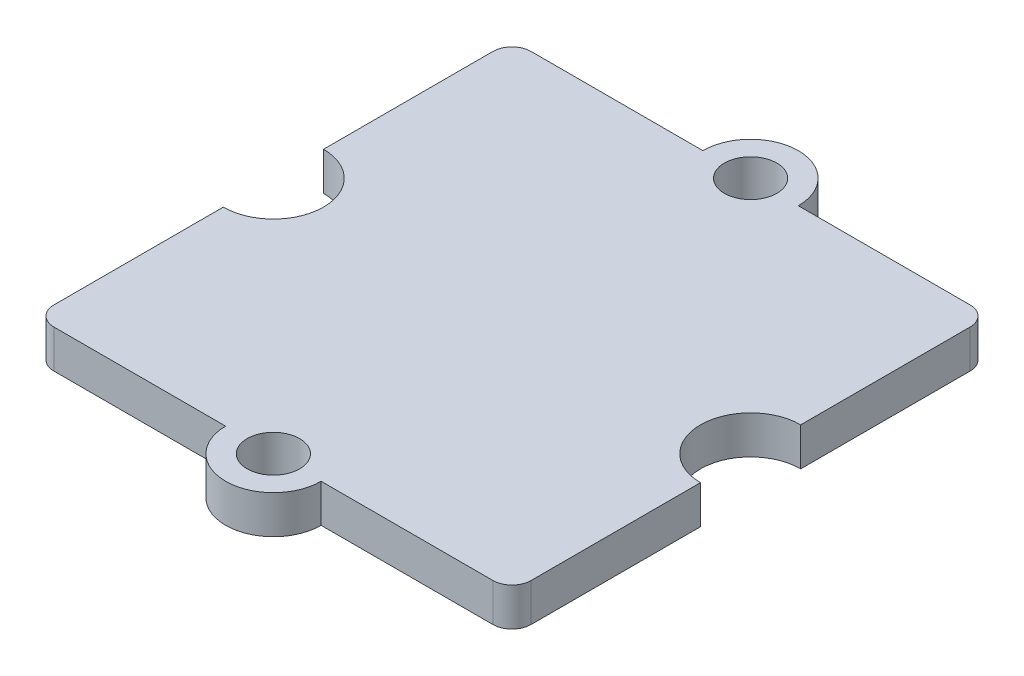
ISO-10303-21;
HEADER;
FILE_DESCRIPTION(('STEP AP214'),'2;1');
FILE_NAME('part.step','',(''),(''),'','','');
FILE_SCHEMA(('AUTOMOTIVE_DESIGN { 1 0 10303 214 1 1 1 1 }'));
ENDSEC;
DATA;
#1=APPLICATION_CONTEXT('core data for automotive mechanical design processes');
#2=APPLICATION_PROTOCOL_DEFINITION('international standard','automotive_design',2000,#1);
#3=PRODUCT_CONTEXT('',#1,'mechanical');
#4=PRODUCT('Part','Part','',(#3));
#5=PRODUCT_RELATED_PRODUCT_CATEGORY('part','',(#4));
#6=PRODUCT_DEFINITION_FORMATION('','',#4);
#7=PRODUCT_DEFINITION_CONTEXT('part definition',#1,'design');
#8=PRODUCT_DEFINITION('design','',#6,#7);
#9=PRODUCT_DEFINITION_SHAPE('','',#8);
#10=(LENGTH_UNIT() NAMED_UNIT(*) SI_UNIT(.MILLI.,.METRE.));
#11=(NAMED_UNIT(*) PLANE_ANGLE_UNIT() SI_UNIT($,.RADIAN.));
#12=(NAMED_UNIT(*) SI_UNIT($,.STERADIAN.) SOLID_ANGLE_UNIT());
#13=UNCERTAINTY_MEASURE_WITH_UNIT(LENGTH_MEASURE(1.E-05),#10,'distance_accuracy_value','');
#14=(GEOMETRIC_REPRESENTATION_CONTEXT(3) GLOBAL_UNCERTAINTY_ASSIGNED_CONTEXT((#13)) GLOBAL_UNIT_ASSIGNED_CONTEXT((#10,
#11,#12)) REPRESENTATION_CONTEXT('',''));
#15=CARTESIAN_POINT('',(0.,0.,0.));
#16=DIRECTION('',(0.,0.,1.));
#17=DIRECTION('',(1.,0.,0.));
#18=AXIS2_PLACEMENT_3D('',#15,#16,#17);
#19=CARTESIAN_POINT('',(0.,0.8,10.));
#20=DIRECTION('',(0.,-1.,0.));
#21=DIRECTION('',(0.,0.,-1.));
#22=AXIS2_PLACEMENT_3D('',#19,#20,#21);
#23=CYLINDRICAL_SURFACE('',#22,2.);
#24=CARTESIAN_POINT('',(0.,-0.8,10.));
#25=DIRECTION('',(0.,1.,0.));
#26=DIRECTION('',(0.,0.,1.));
#27=AXIS2_PLACEMENT_3D('',#24,#25,#26);
#28=CIRCLE('',#27,2.);
#29=CARTESIAN_POINT('',(-2.,-0.8,10.));
#30=VERTEX_POINT('',#29);
#31=CARTESIAN_POINT('',(2.,-0.8,10.));
#32=VERTEX_POINT('',#31);
#33=EDGE_CURVE('E192',#30,#32,#28,.T.);
#34=ORIENTED_EDGE('',*,*,#33,.T.);
#35=DIRECTION('',(0.,-1.,0.));
#36=VECTOR('',#35,1.);
#37=CARTESIAN_POINT('',(2.,0.8,10.));
#38=LINE('',#37,#36);
#39=CARTESIAN_POINT('',(2.,0.8,10.));
#40=VERTEX_POINT('',#39);
#41=EDGE_CURVE('E11',#40,#32,#38,.T.);
#42=ORIENTED_EDGE('',*,*,#41,.F.);
#43=CARTESIAN_POINT('',(0.,0.8,10.));
#44=DIRECTION('',(0.,1.,0.));
#45=DIRECTION('',(0.,0.,1.));
#46=AXIS2_PLACEMENT_3D('',#43,#44,#45);
#47=CIRCLE('',#46,2.);
#48=CARTESIAN_POINT('',(-2.,0.8,10.));
#49=VERTEX_POINT('',#48);
#50=EDGE_CURVE('E233',#49,#40,#47,.T.);
#51=ORIENTED_EDGE('',*,*,#50,.F.);
#52=DIRECTION('',(0.,-1.,0.));
#53=VECTOR('',#52,1.);
#54=CARTESIAN_POINT('',(-2.,0.8,10.));
#55=LINE('',#54,#53);
#56=EDGE_CURVE('E191',#49,#30,#55,.T.);
#57=ORIENTED_EDGE('',*,*,#56,.T.);
#58=EDGE_LOOP('',(#34,#42,#51,#57));
#59=FACE_BOUND('',#58,.T.);
#60=ADVANCED_FACE('F41',(#59),#23,.T.);
#61=CARTESIAN_POINT('',(0.,0.8,10.));
#62=DIRECTION('',(0.,0.,-1.));
#63=DIRECTION('',(-1.,0.,0.));
#64=AXIS2_PLACEMENT_3D('',#61,#62,#63);
#65=PLANE('',#64);
#66=DIRECTION('',(1.,0.,0.));
#67=VECTOR('',#66,1.);
#68=CARTESIAN_POINT('',(0.,-0.8,10.));
#69=LINE('',#68,#67);
#70=CARTESIAN_POINT('',(9.2,-0.8,10.));
#71=VERTEX_POINT('',#70);
#72=EDGE_CURVE('E195',#32,#71,#69,.T.);
#73=ORIENTED_EDGE('',*,*,#72,.T.);
#74=DIRECTION('',(0.,-1.,0.));
#75=VECTOR('',#74,1.);
#76=CARTESIAN_POINT('',(9.2,0.8,10.));
#77=LINE('',#76,#75);
#78=CARTESIAN_POINT('',(9.2,0.8,10.));
#79=VERTEX_POINT('',#78);
#80=EDGE_CURVE('E49',#79,#71,#77,.T.);
#81=ORIENTED_EDGE('',*,*,#80,.F.);
#82=DIRECTION('',(1.,0.,0.));
#83=VECTOR('',#82,1.);
#84=CARTESIAN_POINT('',(0.,0.8,10.));
#85=LINE('',#84,#83);
#86=EDGE_CURVE('E120',#40,#79,#85,.T.);
#87=ORIENTED_EDGE('',*,*,#86,.F.);
#88=ORIENTED_EDGE('',*,*,#41,.T.);
#89=EDGE_LOOP('',(#73,#81,#87,#88));
#90=FACE_BOUND('',#89,.T.);
#91=ADVANCED_FACE('F313',(#90),#65,.F.);
#92=CARTESIAN_POINT('',(9.2,0.8,9.2));
#93=DIRECTION('',(0.,-1.,0.));
#94=DIRECTION('',(0.,0.,-1.));
#95=AXIS2_PLACEMENT_3D('',#92,#93,#94);
#96=CYLINDRICAL_SURFACE('',#95,0.800000000000001);
#97=CARTESIAN_POINT('',(9.2,-0.8,9.2));
#98=DIRECTION('',(0.,1.,0.));
#99=DIRECTION('',(0.,0.,1.));
#100=AXIS2_PLACEMENT_3D('',#97,#98,#99);
#101=CIRCLE('',#100,0.800000000000001);
#102=CARTESIAN_POINT('',(10.,-0.8,9.2));
#103=VERTEX_POINT('',#102);
#104=EDGE_CURVE('E197',#71,#103,#101,.T.);
#105=ORIENTED_EDGE('',*,*,#104,.T.);
#106=DIRECTION('',(0.,-1.,0.));
#107=VECTOR('',#106,1.);
#108=CARTESIAN_POINT('',(10.,0.8,9.2));
#109=LINE('',#108,#107);
#110=CARTESIAN_POINT('',(10.,0.8,9.2));
#111=VERTEX_POINT('',#110);
#112=EDGE_CURVE('E255',#111,#103,#109,.T.);
#113=ORIENTED_EDGE('',*,*,#112,.F.);
#114=CARTESIAN_POINT('',(9.2,0.8,9.2));
#115=DIRECTION('',(0.,1.,0.));
#116=DIRECTION('',(0.,0.,1.));
#117=AXIS2_PLACEMENT_3D('',#114,#115,#116);
#118=CIRCLE('',#117,0.800000000000001);
#119=EDGE_CURVE('E263',#79,#111,#118,.T.);
#120=ORIENTED_EDGE('',*,*,#119,.F.);
#121=ORIENTED_EDGE('',*,*,#80,.T.);
#122=EDGE_LOOP('',(#105,#113,#120,#121));
#123=FACE_BOUND('',#122,.T.);
#124=ADVANCED_FACE('F261',(#123),#96,.T.);
#125=CARTESIAN_POINT('',(10.,0.8,0.));
#126=DIRECTION('',(-1.,0.,0.));
#127=DIRECTION('',(0.,0.,1.));
#128=AXIS2_PLACEMENT_3D('',#125,#126,#127);
#129=PLANE('',#128);
#130=DIRECTION('',(0.,0.,-1.));
#131=VECTOR('',#130,1.);
#132=CARTESIAN_POINT('',(10.,-0.8,0.));
#133=LINE('',#132,#131);
#134=CARTESIAN_POINT('',(10.,-0.8,2.10000000000001));
#135=VERTEX_POINT('',#134);
#136=EDGE_CURVE('E199',#103,#135,#133,.T.);
#137=ORIENTED_EDGE('',*,*,#136,.T.);
#138=DIRECTION('',(0.,-1.,0.));
#139=VECTOR('',#138,1.);
#140=CARTESIAN_POINT('',(10.,0.8,2.10000000000001));
#141=LINE('',#140,#139);
#142=CARTESIAN_POINT('',(10.,0.8,2.10000000000001));
#143=VERTEX_POINT('',#142);
#144=EDGE_CURVE('E253',#143,#135,#141,.T.);
#145=ORIENTED_EDGE('',*,*,#144,.F.);
#146=DIRECTION('',(0.,0.,-1.));
#147=VECTOR('',#146,1.);
#148=CARTESIAN_POINT('',(10.,0.8,0.));
#149=LINE('',#148,#147);
#150=EDGE_CURVE('E276',#111,#143,#149,.T.);
#151=ORIENTED_EDGE('',*,*,#150,.F.);
#152=ORIENTED_EDGE('',*,*,#112,.T.);
#153=EDGE_LOOP('',(#137,#145,#151,#152));
#154=FACE_BOUND('',#153,.T.);
#155=ADVANCED_FACE('F273',(#154),#129,.F.);
#156=CARTESIAN_POINT('',(10.,0.8,0.));
#157=DIRECTION('',(0.,-1.,0.));
#158=DIRECTION('',(0.,0.,-1.));
#159=AXIS2_PLACEMENT_3D('',#156,#157,#158);
#160=CYLINDRICAL_SURFACE('',#159,2.1);
#161=CARTESIAN_POINT('',(10.,-0.8,0.));
#162=DIRECTION('',(0.,1.,0.));
#163=DIRECTION('',(0.,0.,1.));
#164=AXIS2_PLACEMENT_3D('',#161,#162,#163);
#165=CIRCLE('',#164,2.1);
#166=CARTESIAN_POINT('',(10.,-0.8,-2.09999999999999));
#167=VERTEX_POINT('',#166);
#168=EDGE_CURVE('E202',#167,#135,#165,.T.);
#169=ORIENTED_EDGE('',*,*,#168,.F.);
#170=DIRECTION('',(0.,-1.,0.));
#171=VECTOR('',#170,1.);
#172=CARTESIAN_POINT('',(10.,0.8,-2.09999999999999));
#173=LINE('',#172,#171);
#174=CARTESIAN_POINT('',(10.,0.8,-2.09999999999999));
#175=VERTEX_POINT('',#174);
#176=EDGE_CURVE('E251',#175,#167,#173,.T.);
#177=ORIENTED_EDGE('',*,*,#176,.F.);
#178=CARTESIAN_POINT('',(10.,0.8,0.));
#179=DIRECTION('',(0.,1.,0.));
#180=DIRECTION('',(0.,0.,1.));
#181=AXIS2_PLACEMENT_3D('',#178,#179,#180);
#182=CIRCLE('',#181,2.1);
#183=EDGE_CURVE('E278',#175,#143,#182,.T.);
#184=ORIENTED_EDGE('',*,*,#183,.T.);
#185=ORIENTED_EDGE('',*,*,#144,.T.);
#186=EDGE_LOOP('',(#169,#177,#184,#185));
#187=FACE_BOUND('',#186,.T.);
#188=ADVANCED_FACE('F342',(#187),#160,.F.);
#189=CARTESIAN_POINT('',(10.,-0.8,-9.20000000000001));
#190=VERTEX_POINT('',#189);
#191=EDGE_CURVE('E203',#167,#190,#133,.T.);
#192=ORIENTED_EDGE('',*,*,#191,.T.);
#193=DIRECTION('',(0.,-1.,0.));
#194=VECTOR('',#193,1.);
#195=CARTESIAN_POINT('',(10.,0.8,-9.20000000000001));
#196=LINE('',#195,#194);
#197=CARTESIAN_POINT('',(10.,0.8,-9.20000000000001));
#198=VERTEX_POINT('',#197);
#199=EDGE_CURVE('E249',#198,#190,#196,.T.);
#200=ORIENTED_EDGE('',*,*,#199,.F.);
#201=EDGE_CURVE('E280',#175,#198,#149,.T.);
#202=ORIENTED_EDGE('',*,*,#201,.F.);
#203=ORIENTED_EDGE('',*,*,#176,.T.);
#204=EDGE_LOOP('',(#192,#200,#202,#203));
#205=FACE_BOUND('',#204,.T.);
#206=ADVANCED_FACE('F344',(#205),#129,.F.);
#207=CARTESIAN_POINT('',(9.2,0.8,-9.20000000000001));
#208=DIRECTION('',(0.,-1.,0.));
#209=DIRECTION('',(0.,0.,-1.));
#210=AXIS2_PLACEMENT_3D('',#207,#208,#209);
#211=CYLINDRICAL_SURFACE('',#210,0.800000000000002);
#212=CARTESIAN_POINT('',(9.2,-0.8,-9.20000000000001));
#213=DIRECTION('',(0.,1.,0.));
#214=DIRECTION('',(0.,0.,1.));
#215=AXIS2_PLACEMENT_3D('',#212,#213,#214);
#216=CIRCLE('',#215,0.800000000000002);
#217=CARTESIAN_POINT('',(9.2,-0.8,-10.));
#218=VERTEX_POINT('',#217);
#219=EDGE_CURVE('E206',#218,#190,#216,.F.);
#220=ORIENTED_EDGE('',*,*,#219,.F.);
#221=DIRECTION('',(0.,-1.,0.));
#222=VECTOR('',#221,1.);
#223=CARTESIAN_POINT('',(9.2,0.8,-10.));
#224=LINE('',#223,#222);
#225=CARTESIAN_POINT('',(9.2,0.8,-10.));
#226=VERTEX_POINT('',#225);
#227=EDGE_CURVE('E247',#226,#218,#224,.T.);
#228=ORIENTED_EDGE('',*,*,#227,.F.);
#229=CARTESIAN_POINT('',(9.2,0.8,-9.20000000000001));
#230=DIRECTION('',(0.,1.,0.));
#231=DIRECTION('',(0.,0.,1.));
#232=AXIS2_PLACEMENT_3D('',#229,#230,#231);
#233=CIRCLE('',#232,0.800000000000002);
#234=EDGE_CURVE('E283',#226,#198,#233,.F.);
#235=ORIENTED_EDGE('',*,*,#234,.T.);
#236=ORIENTED_EDGE('',*,*,#199,.T.);
#237=EDGE_LOOP('',(#220,#228,#235,#236));
#238=FACE_BOUND('',#237,.T.);
#239=ADVANCED_FACE('F357',(#238),#211,.T.);
#240=CARTESIAN_POINT('',(0.,0.8,-10.));
#241=DIRECTION('',(0.,0.,-1.));
#242=DIRECTION('',(-1.,0.,0.));
#243=AXIS2_PLACEMENT_3D('',#240,#241,#242);
#244=PLANE('',#243);
#245=DIRECTION('',(1.,0.,0.));
#246=VECTOR('',#245,1.);
#247=CARTESIAN_POINT('',(0.,-0.8,-10.));
#248=LINE('',#247,#246);
#249=CARTESIAN_POINT('',(2.,-0.8,-10.));
#250=VERTEX_POINT('',#249);
#251=EDGE_CURVE('E209',#250,#218,#248,.T.);
#252=ORIENTED_EDGE('',*,*,#251,.F.);
#253=DIRECTION('',(0.,-1.,0.));
#254=VECTOR('',#253,1.);
#255=CARTESIAN_POINT('',(2.,0.8,-10.));
#256=LINE('',#255,#254);
#257=CARTESIAN_POINT('',(2.,0.8,-10.));
#258=VERTEX_POINT('',#257);
#259=EDGE_CURVE('E245',#258,#250,#256,.T.);
#260=ORIENTED_EDGE('',*,*,#259,.F.);
#261=DIRECTION('',(1.,0.,0.));
#262=VECTOR('',#261,1.);
#263=CARTESIAN_POINT('',(0.,0.8,-10.));
#264=LINE('',#263,#262);
#265=EDGE_CURVE('E288',#258,#226,#264,.T.);
#266=ORIENTED_EDGE('',*,*,#265,.T.);
#267=ORIENTED_EDGE('',*,*,#227,.T.);
#268=EDGE_LOOP('',(#252,#260,#266,#267));
#269=FACE_BOUND('',#268,.T.);
#270=ADVANCED_FACE('F364',(#269),#244,.T.);
#271=CARTESIAN_POINT('',(0.,0.8,-9.99999999999999));
#272=DIRECTION('',(0.,-1.,0.));
#273=DIRECTION('',(0.,0.,-1.));
#274=AXIS2_PLACEMENT_3D('',#271,#272,#273);
#275=CYLINDRICAL_SURFACE('',#274,2.);
#276=CARTESIAN_POINT('',(0.,-0.8,-9.99999999999999));
#277=DIRECTION('',(0.,1.,0.));
#278=DIRECTION('',(0.,0.,1.));
#279=AXIS2_PLACEMENT_3D('',#276,#277,#278);
#280=CIRCLE('',#279,2.);
#281=CARTESIAN_POINT('',(-2.,-0.8,-10.));
#282=VERTEX_POINT('',#281);
#283=EDGE_CURVE('E212',#250,#282,#280,.T.);
#284=ORIENTED_EDGE('',*,*,#283,.T.);
#285=DIRECTION('',(0.,-1.,0.));
#286=VECTOR('',#285,1.);
#287=CARTESIAN_POINT('',(-2.,0.8,-10.));
#288=LINE('',#287,#286);
#289=CARTESIAN_POINT('',(-2.,0.8,-10.));
#290=VERTEX_POINT('',#289);
#291=EDGE_CURVE('E243',#290,#282,#288,.T.);
#292=ORIENTED_EDGE('',*,*,#291,.F.);
#293=CARTESIAN_POINT('',(0.,0.8,-9.99999999999999));
#294=DIRECTION('',(0.,1.,0.));
#295=DIRECTION('',(0.,0.,1.));
#296=AXIS2_PLACEMENT_3D('',#293,#294,#295);
#297=CIRCLE('',#296,2.);
#298=EDGE_CURVE('E292',#258,#290,#297,.T.);
#299=ORIENTED_EDGE('',*,*,#298,.F.);
#300=ORIENTED_EDGE('',*,*,#259,.T.);
#301=EDGE_LOOP('',(#284,#292,#299,#300));
#302=FACE_BOUND('',#301,.T.);
#303=ADVANCED_FACE('F371',(#302),#275,.T.);
#304=CARTESIAN_POINT('',(-9.2,-0.8,-10.));
#305=VERTEX_POINT('',#304);
#306=EDGE_CURVE('E213',#305,#282,#248,.T.);
#307=ORIENTED_EDGE('',*,*,#306,.F.);
#308=DIRECTION('',(0.,-1.,0.));
#309=VECTOR('',#308,1.);
#310=CARTESIAN_POINT('',(-9.2,0.8,-10.));
#311=LINE('',#310,#309);
#312=CARTESIAN_POINT('',(-9.2,0.8,-10.));
#313=VERTEX_POINT('',#312);
#314=EDGE_CURVE('E241',#313,#305,#311,.T.);
#315=ORIENTED_EDGE('',*,*,#314,.F.);
#316=EDGE_CURVE('E294',#313,#290,#264,.T.);
#317=ORIENTED_EDGE('',*,*,#316,.T.);
#318=ORIENTED_EDGE('',*,*,#291,.T.);
#319=EDGE_LOOP('',(#307,#315,#317,#318));
#320=FACE_BOUND('',#319,.T.);
#321=ADVANCED_FACE('F374',(#320),#244,.T.);
#322=CARTESIAN_POINT('',(-9.2,0.8,-9.20000000000001));
#323=DIRECTION('',(0.,-1.,0.));
#324=DIRECTION('',(0.,0.,-1.));
#325=AXIS2_PLACEMENT_3D('',#322,#323,#324);
#326=CYLINDRICAL_SURFACE('',#325,0.800000000000002);
#327=CARTESIAN_POINT('',(-9.2,-0.8,-9.20000000000001));
#328=DIRECTION('',(0.,1.,0.));
#329=DIRECTION('',(0.,0.,1.));
#330=AXIS2_PLACEMENT_3D('',#327,#328,#329);
#331=CIRCLE('',#330,0.800000000000002);
#332=CARTESIAN_POINT('',(-10.,-0.8,-9.20000000000001));
#333=VERTEX_POINT('',#332);
#334=EDGE_CURVE('E216',#333,#305,#331,.F.);
#335=ORIENTED_EDGE('',*,*,#334,.F.);
#336=DIRECTION('',(0.,-1.,0.));
#337=VECTOR('',#336,1.);
#338=CARTESIAN_POINT('',(-10.,0.8,-9.20000000000001));
#339=LINE('',#338,#337);
#340=CARTESIAN_POINT('',(-10.,0.8,-9.20000000000001));
#341=VERTEX_POINT('',#340);
#342=EDGE_CURVE('E239',#341,#333,#339,.T.);
#343=ORIENTED_EDGE('',*,*,#342,.F.);
#344=CARTESIAN_POINT('',(-9.2,0.8,-9.20000000000001));
#345=DIRECTION('',(0.,1.,0.));
#346=DIRECTION('',(0.,0.,1.));
#347=AXIS2_PLACEMENT_3D('',#344,#345,#346);
#348=CIRCLE('',#347,0.800000000000002);
#349=EDGE_CURVE('E297',#341,#313,#348,.F.);
#350=ORIENTED_EDGE('',*,*,#349,.T.);
#351=ORIENTED_EDGE('',*,*,#314,.T.);
#352=EDGE_LOOP('',(#335,#343,#350,#351));
#353=FACE_BOUND('',#352,.T.);
#354=ADVANCED_FACE('F387',(#353),#326,.T.);
#355=CARTESIAN_POINT('',(-10.,0.8,0.));
#356=DIRECTION('',(-1.,0.,0.));
#357=DIRECTION('',(0.,0.,1.));
#358=AXIS2_PLACEMENT_3D('',#355,#356,#357);
#359=PLANE('',#358);
#360=DIRECTION('',(0.,0.,-1.));
#361=VECTOR('',#360,1.);
#362=CARTESIAN_POINT('',(-10.,-0.8,0.));
#363=LINE('',#362,#361);
#364=CARTESIAN_POINT('',(-10.,-0.8,-2.09999999999999));
#365=VERTEX_POINT('',#364);
#366=EDGE_CURVE('E219',#365,#333,#363,.T.);
#367=ORIENTED_EDGE('',*,*,#366,.F.);
#368=DIRECTION('',(0.,-1.,0.));
#369=VECTOR('',#368,1.);
#370=CARTESIAN_POINT('',(-10.,0.8,-2.09999999999999));
#371=LINE('',#370,#369);
#372=CARTESIAN_POINT('',(-10.,0.8,-2.09999999999999));
#373=VERTEX_POINT('',#372);
#374=EDGE_CURVE('E237',#373,#365,#371,.T.);
#375=ORIENTED_EDGE('',*,*,#374,.F.);
#376=DIRECTION('',(0.,0.,-1.));
#377=VECTOR('',#376,1.);
#378=CARTESIAN_POINT('',(-10.,0.8,0.));
#379=LINE('',#378,#377);
#380=EDGE_CURVE('E179',#373,#341,#379,.T.);
#381=ORIENTED_EDGE('',*,*,#380,.T.);
#382=ORIENTED_EDGE('',*,*,#342,.T.);
#383=EDGE_LOOP('',(#367,#375,#381,#382));
#384=FACE_BOUND('',#383,.T.);
#385=ADVANCED_FACE('F394',(#384),#359,.T.);
#386=CARTESIAN_POINT('',(-10.,0.8,0.));
#387=DIRECTION('',(0.,-1.,0.));
#388=DIRECTION('',(0.,0.,-1.));
#389=AXIS2_PLACEMENT_3D('',#386,#387,#388);
#390=CYLINDRICAL_SURFACE('',#389,2.1);
#391=CARTESIAN_POINT('',(-10.,-0.8,0.));
#392=DIRECTION('',(0.,1.,0.));
#393=DIRECTION('',(0.,0.,1.));
#394=AXIS2_PLACEMENT_3D('',#391,#392,#393);
#395=CIRCLE('',#394,2.1);
#396=CARTESIAN_POINT('',(-10.,-0.8,2.10000000000001));
#397=VERTEX_POINT('',#396);
#398=EDGE_CURVE('E222',#397,#365,#395,.T.);
#399=ORIENTED_EDGE('',*,*,#398,.F.);
#400=DIRECTION('',(0.,-1.,0.));
#401=VECTOR('',#400,1.);
#402=CARTESIAN_POINT('',(-10.,0.8,2.10000000000001));
#403=LINE('',#402,#401);
#404=CARTESIAN_POINT('',(-10.,0.8,2.10000000000001));
#405=VERTEX_POINT('',#404);
#406=EDGE_CURVE('E169',#405,#397,#403,.T.);
#407=ORIENTED_EDGE('',*,*,#406,.F.);
#408=CARTESIAN_POINT('',(-10.,0.8,0.));
#409=DIRECTION('',(0.,1.,0.));
#410=DIRECTION('',(0.,0.,1.));
#411=AXIS2_PLACEMENT_3D('',#408,#409,#410);
#412=CIRCLE('',#411,2.1);
#413=EDGE_CURVE('E177',#405,#373,#412,.T.);
#414=ORIENTED_EDGE('',*,*,#413,.T.);
#415=ORIENTED_EDGE('',*,*,#374,.T.);
#416=EDGE_LOOP('',(#399,#407,#414,#415));
#417=FACE_BOUND('',#416,.T.);
#418=ADVANCED_FACE('F303',(#417),#390,.F.);
#419=CARTESIAN_POINT('',(-10.,-0.8,9.2));
#420=VERTEX_POINT('',#419);
#421=EDGE_CURVE('E164',#420,#397,#363,.T.);
#422=ORIENTED_EDGE('',*,*,#421,.F.);
#423=DIRECTION('',(0.,-1.,0.));
#424=VECTOR('',#423,1.);
#425=CARTESIAN_POINT('',(-10.,0.8,9.2));
#426=LINE('',#425,#424);
#427=CARTESIAN_POINT('',(-10.,0.8,9.2));
#428=VERTEX_POINT('',#427);
#429=EDGE_CURVE('E159',#428,#420,#426,.T.);
#430=ORIENTED_EDGE('',*,*,#429,.F.);
#431=EDGE_CURVE('E162',#428,#405,#379,.T.);
#432=ORIENTED_EDGE('',*,*,#431,.T.);
#433=ORIENTED_EDGE('',*,*,#406,.T.);
#434=EDGE_LOOP('',(#422,#430,#432,#433));
#435=FACE_BOUND('',#434,.T.);
#436=ADVANCED_FACE('F161',(#435),#359,.T.);
#437=CARTESIAN_POINT('',(-9.19999999999999,0.8,9.2));
#438=DIRECTION('',(0.,-1.,0.));
#439=DIRECTION('',(0.,0.,-1.));
#440=AXIS2_PLACEMENT_3D('',#437,#438,#439);
#441=CYLINDRICAL_SURFACE('',#440,0.800000000000001);
#442=CARTESIAN_POINT('',(-9.19999999999999,-0.8,9.2));
#443=DIRECTION('',(0.,1.,0.));
#444=DIRECTION('',(0.,0.,1.));
#445=AXIS2_PLACEMENT_3D('',#442,#443,#444);
#446=CIRCLE('',#445,0.800000000000001);
#447=CARTESIAN_POINT('',(-9.19999999999999,-0.8,10.));
#448=VERTEX_POINT('',#447);
#449=EDGE_CURVE('E225',#448,#420,#446,.F.);
#450=ORIENTED_EDGE('',*,*,#449,.F.);
#451=DIRECTION('',(0.,-1.,0.));
#452=VECTOR('',#451,1.);
#453=CARTESIAN_POINT('',(-9.19999999999999,0.8,10.));
#454=LINE('',#453,#452);
#455=CARTESIAN_POINT('',(-9.19999999999999,0.8,10.));
#456=VERTEX_POINT('',#455);
#457=EDGE_CURVE('E109',#456,#448,#454,.T.);
#458=ORIENTED_EDGE('',*,*,#457,.F.);
#459=CARTESIAN_POINT('',(-9.19999999999999,0.8,9.2));
#460=DIRECTION('',(0.,1.,0.));
#461=DIRECTION('',(0.,0.,1.));
#462=AXIS2_PLACEMENT_3D('',#459,#460,#461);
#463=CIRCLE('',#462,0.800000000000001);
#464=EDGE_CURVE('E174',#456,#428,#463,.F.);
#465=ORIENTED_EDGE('',*,*,#464,.T.);
#466=ORIENTED_EDGE('',*,*,#429,.T.);
#467=EDGE_LOOP('',(#450,#458,#465,#466));
#468=FACE_BOUND('',#467,.T.);
#469=ADVANCED_FACE('F180',(#468),#441,.T.);
#470=CARTESIAN_POINT('',(0.,0.8,-9.99999999999999));
#471=DIRECTION('',(0.,-1.,0.));
#472=DIRECTION('',(0.,0.,-1.));
#473=AXIS2_PLACEMENT_3D('',#470,#471,#472);
#474=CYLINDRICAL_SURFACE('',#473,1.1);
#475=CARTESIAN_POINT('',(0.,0.8,-9.99999999999999));
#476=DIRECTION('',(0.,1.,0.));
#477=DIRECTION('',(0.,0.,1.));
#478=AXIS2_PLACEMENT_3D('',#475,#476,#477);
#479=CIRCLE('',#478,1.1);
#480=CARTESIAN_POINT('',(0.,0.8,-8.9));
#481=VERTEX_POINT('',#480);
#482=EDGE_CURVE('E182',#481,#481,#479,.T.);
#483=ORIENTED_EDGE('',*,*,#482,.T.);
#484=EDGE_LOOP('',(#483));
#485=FACE_BOUND('',#484,.T.);
#486=CARTESIAN_POINT('',(0.,-0.8,-9.99999999999999));
#487=DIRECTION('',(0.,1.,0.));
#488=DIRECTION('',(0.,0.,1.));
#489=AXIS2_PLACEMENT_3D('',#486,#487,#488);
#490=CIRCLE('',#489,1.1);
#491=CARTESIAN_POINT('',(0.,-0.8,-8.9));
#492=VERTEX_POINT('',#491);
#493=EDGE_CURVE('E227',#492,#492,#490,.T.);
#494=ORIENTED_EDGE('',*,*,#493,.F.);
#495=EDGE_LOOP('',(#494));
#496=FACE_BOUND('',#495,.T.);
#497=ADVANCED_FACE('F311',(#485,#496),#474,.F.);
#498=EDGE_CURVE('E112',#448,#30,#69,.T.);
#499=ORIENTED_EDGE('',*,*,#498,.T.);
#500=ORIENTED_EDGE('',*,*,#56,.F.);
#501=EDGE_CURVE('E57',#456,#49,#85,.T.);
#502=ORIENTED_EDGE('',*,*,#501,.F.);
#503=ORIENTED_EDGE('',*,*,#457,.T.);
#504=EDGE_LOOP('',(#499,#500,#502,#503));
#505=FACE_BOUND('',#504,.T.);
#506=ADVANCED_FACE('F308',(#505),#65,.F.);
#507=CARTESIAN_POINT('',(0.,0.8,10.));
#508=DIRECTION('',(0.,-1.,0.));
#509=DIRECTION('',(0.,0.,-1.));
#510=AXIS2_PLACEMENT_3D('',#507,#508,#509);
#511=CYLINDRICAL_SURFACE('',#510,1.1);
#512=CARTESIAN_POINT('',(0.,0.8,10.));
#513=DIRECTION('',(0.,1.,0.));
#514=DIRECTION('',(0.,0.,1.));
#515=AXIS2_PLACEMENT_3D('',#512,#513,#514);
#516=CIRCLE('',#515,1.1);
#517=CARTESIAN_POINT('',(0.,0.8,11.1));
#518=VERTEX_POINT('',#517);
#519=EDGE_CURVE('E188',#518,#518,#516,.T.);
#520=ORIENTED_EDGE('',*,*,#519,.T.);
#521=EDGE_LOOP('',(#520));
#522=FACE_BOUND('',#521,.T.);
#523=CARTESIAN_POINT('',(0.,-0.8,10.));
#524=DIRECTION('',(0.,1.,0.));
#525=DIRECTION('',(0.,0.,1.));
#526=AXIS2_PLACEMENT_3D('',#523,#524,#525);
#527=CIRCLE('',#526,1.1);
#528=CARTESIAN_POINT('',(0.,-0.8,11.1));
#529=VERTEX_POINT('',#528);
#530=EDGE_CURVE('E230',#529,#529,#527,.T.);
#531=ORIENTED_EDGE('',*,*,#530,.F.);
#532=EDGE_LOOP('',(#531));
#533=FACE_BOUND('',#532,.T.);
#534=ADVANCED_FACE('F310',(#522,#533),#511,.F.);
#535=CARTESIAN_POINT('',(0.,0.8,0.));
#536=DIRECTION('',(0.,1.,0.));
#537=DIRECTION('',(0.,0.,1.));
#538=AXIS2_PLACEMENT_3D('',#535,#536,#537);
#539=PLANE('',#538);
#540=ORIENTED_EDGE('',*,*,#50,.T.);
#541=ORIENTED_EDGE('',*,*,#86,.T.);
#542=ORIENTED_EDGE('',*,*,#119,.T.);
#543=ORIENTED_EDGE('',*,*,#150,.T.);
#544=ORIENTED_EDGE('',*,*,#183,.F.);
#545=ORIENTED_EDGE('',*,*,#201,.T.);
#546=ORIENTED_EDGE('',*,*,#234,.F.);
#547=ORIENTED_EDGE('',*,*,#265,.F.);
#548=ORIENTED_EDGE('',*,*,#298,.T.);
#549=ORIENTED_EDGE('',*,*,#316,.F.);
#550=ORIENTED_EDGE('',*,*,#349,.F.);
#551=ORIENTED_EDGE('',*,*,#380,.F.);
#552=ORIENTED_EDGE('',*,*,#413,.F.);
#553=ORIENTED_EDGE('',*,*,#431,.F.);
#554=ORIENTED_EDGE('',*,*,#464,.F.);
#555=ORIENTED_EDGE('',*,*,#501,.T.);
#556=EDGE_LOOP('',(#540,#541,#542,#543,#544,#545,#546,#547,#548,#549,#550,#551,#552,#553,#554,#555));
#557=FACE_BOUND('',#556,.T.);
#558=ORIENTED_EDGE('',*,*,#482,.F.);
#559=EDGE_LOOP('',(#558));
#560=FACE_BOUND('',#559,.T.);
#561=ORIENTED_EDGE('',*,*,#519,.F.);
#562=EDGE_LOOP('',(#561));
#563=FACE_BOUND('',#562,.T.);
#564=ADVANCED_FACE('F172',(#557,#560,#563),#539,.T.);
#565=CARTESIAN_POINT('',(0.,-0.8,0.));
#566=DIRECTION('',(0.,1.,0.));
#567=DIRECTION('',(0.,0.,1.));
#568=AXIS2_PLACEMENT_3D('',#565,#566,#567);
#569=PLANE('',#568);
#570=ORIENTED_EDGE('',*,*,#33,.F.);
#571=ORIENTED_EDGE('',*,*,#498,.F.);
#572=ORIENTED_EDGE('',*,*,#449,.T.);
#573=ORIENTED_EDGE('',*,*,#421,.T.);
#574=ORIENTED_EDGE('',*,*,#398,.T.);
#575=ORIENTED_EDGE('',*,*,#366,.T.);
#576=ORIENTED_EDGE('',*,*,#334,.T.);
#577=ORIENTED_EDGE('',*,*,#306,.T.);
#578=ORIENTED_EDGE('',*,*,#283,.F.);
#579=ORIENTED_EDGE('',*,*,#251,.T.);
#580=ORIENTED_EDGE('',*,*,#219,.T.);
#581=ORIENTED_EDGE('',*,*,#191,.F.);
#582=ORIENTED_EDGE('',*,*,#168,.T.);
#583=ORIENTED_EDGE('',*,*,#136,.F.);
#584=ORIENTED_EDGE('',*,*,#104,.F.);
#585=ORIENTED_EDGE('',*,*,#72,.F.);
#586=EDGE_LOOP('',(#570,#571,#572,#573,#574,#575,#576,#577,#578,#579,#580,#581,#582,#583,#584,#585));
#587=FACE_BOUND('',#586,.T.);
#588=ORIENTED_EDGE('',*,*,#493,.T.);
#589=EDGE_LOOP('',(#588));
#590=FACE_BOUND('',#589,.T.);
#591=ORIENTED_EDGE('',*,*,#530,.T.);
#592=EDGE_LOOP('',(#591));
#593=FACE_BOUND('',#592,.T.);
#594=ADVANCED_FACE('F267',(#587,#590,#593),#569,.F.);
#595=CLOSED_SHELL('',(#60,#91,#124,#155,#188,#206,#239,#270,#303,#321,#354,#385,#418,#436,#469,
#497,#506,#534,#564,#594));
#596=MANIFOLD_SOLID_BREP('B2',#595);
#597=ADVANCED_BREP_SHAPE_REPRESENTATION('',(#18,#596),#14);
#598=SHAPE_DEFINITION_REPRESENTATION(#9,#597);
ENDSEC;
END-ISO-10303-21;
